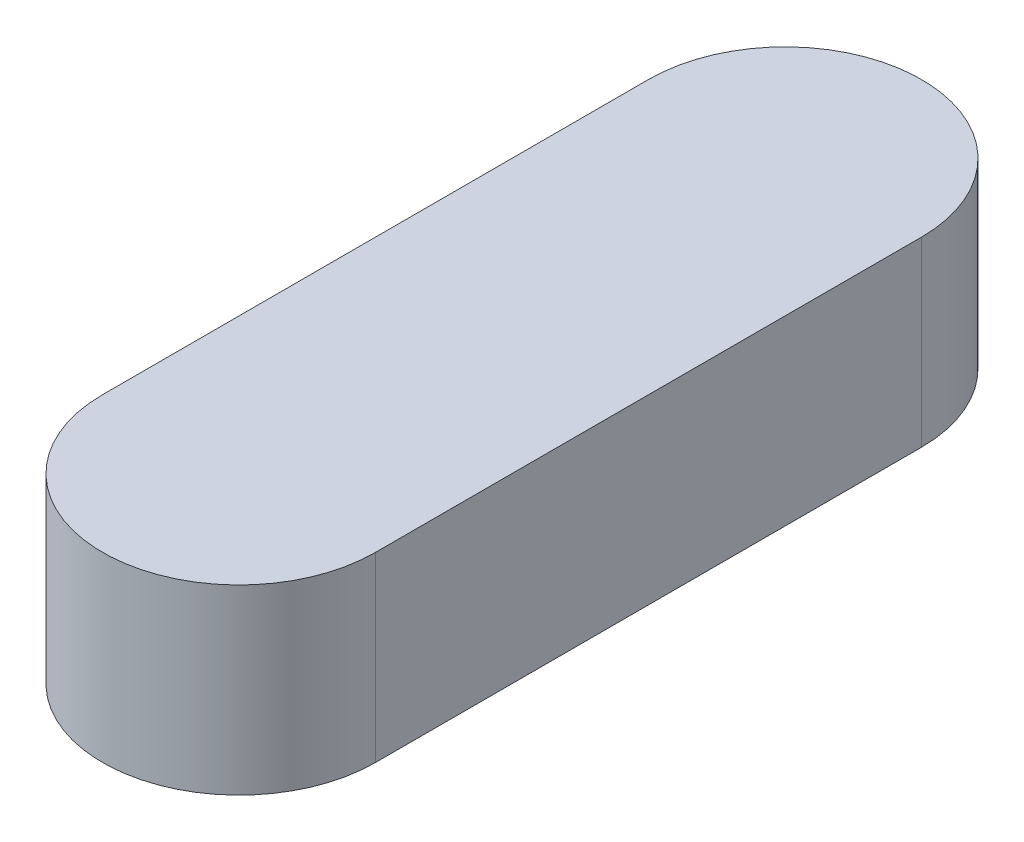
ISO-10303-21;
HEADER;
FILE_DESCRIPTION(('STEP AP214'),'2;1');
FILE_NAME('part.step','',(''),(''),'','','');
FILE_SCHEMA(('AUTOMOTIVE_DESIGN { 1 0 10303 214 1 1 1 1 }'));
ENDSEC;
DATA;
#1=APPLICATION_CONTEXT('core data for automotive mechanical design processes');
#2=APPLICATION_PROTOCOL_DEFINITION('international standard','automotive_design',2000,#1);
#3=PRODUCT_CONTEXT('',#1,'mechanical');
#4=PRODUCT('Part','Part','',(#3));
#5=PRODUCT_RELATED_PRODUCT_CATEGORY('part','',(#4));
#6=PRODUCT_DEFINITION_FORMATION('','',#4);
#7=PRODUCT_DEFINITION_CONTEXT('part definition',#1,'design');
#8=PRODUCT_DEFINITION('design','',#6,#7);
#9=PRODUCT_DEFINITION_SHAPE('','',#8);
#10=(LENGTH_UNIT() NAMED_UNIT(*) SI_UNIT(.MILLI.,.METRE.));
#11=(NAMED_UNIT(*) PLANE_ANGLE_UNIT() SI_UNIT($,.RADIAN.));
#12=(NAMED_UNIT(*) SI_UNIT($,.STERADIAN.) SOLID_ANGLE_UNIT());
#13=UNCERTAINTY_MEASURE_WITH_UNIT(LENGTH_MEASURE(1.E-05),#10,'distance_accuracy_value','');
#14=(GEOMETRIC_REPRESENTATION_CONTEXT(3) GLOBAL_UNCERTAINTY_ASSIGNED_CONTEXT((#13)) GLOBAL_UNIT_ASSIGNED_CONTEXT((#10,
#11,#12)) REPRESENTATION_CONTEXT('',''));
#15=CARTESIAN_POINT('',(0.,0.,0.));
#16=DIRECTION('',(0.,0.,1.));
#17=DIRECTION('',(1.,0.,0.));
#18=AXIS2_PLACEMENT_3D('',#15,#16,#17);
#19=CARTESIAN_POINT('',(0.,4.,-12.));
#20=DIRECTION('',(0.,-1.,0.));
#21=DIRECTION('',(0.,0.,-1.));
#22=AXIS2_PLACEMENT_3D('',#19,#20,#21);
#23=CYLINDRICAL_SURFACE('',#22,6.);
#24=CARTESIAN_POINT('',(0.,-4.,-12.));
#25=DIRECTION('',(0.,1.,0.));
#26=DIRECTION('',(0.,0.,1.));
#27=AXIS2_PLACEMENT_3D('',#24,#25,#26);
#28=CIRCLE('',#27,6.);
#29=CARTESIAN_POINT('',(6.,-4.,-12.));
#30=VERTEX_POINT('',#29);
#31=CARTESIAN_POINT('',(-6.,-4.,-12.));
#32=VERTEX_POINT('',#31);
#33=EDGE_CURVE('E100',#30,#32,#28,.T.);
#34=ORIENTED_EDGE('',*,*,#33,.T.);
#35=DIRECTION('',(0.,-1.,0.));
#36=VECTOR('',#35,1.);
#37=CARTESIAN_POINT('',(-6.,4.,-12.));
#38=LINE('',#37,#36);
#39=CARTESIAN_POINT('',(-6.,4.,-12.));
#40=VERTEX_POINT('',#39);
#41=EDGE_CURVE('E11',#40,#32,#38,.T.);
#42=ORIENTED_EDGE('',*,*,#41,.F.);
#43=CARTESIAN_POINT('',(0.,4.,-12.));
#44=DIRECTION('',(0.,1.,0.));
#45=DIRECTION('',(0.,0.,1.));
#46=AXIS2_PLACEMENT_3D('',#43,#44,#45);
#47=CIRCLE('',#46,6.);
#48=CARTESIAN_POINT('',(6.,4.,-12.));
#49=VERTEX_POINT('',#48);
#50=EDGE_CURVE('E88',#49,#40,#47,.T.);
#51=ORIENTED_EDGE('',*,*,#50,.F.);
#52=DIRECTION('',(0.,-1.,0.));
#53=VECTOR('',#52,1.);
#54=CARTESIAN_POINT('',(6.,4.,-12.));
#55=LINE('',#54,#53);
#56=EDGE_CURVE('E96',#49,#30,#55,.T.);
#57=ORIENTED_EDGE('',*,*,#56,.T.);
#58=EDGE_LOOP('',(#34,#42,#51,#57));
#59=FACE_BOUND('',#58,.T.);
#60=ADVANCED_FACE('F37',(#59),#23,.T.);
#61=CARTESIAN_POINT('',(-6.,4.,-12.));
#62=DIRECTION('',(1.,0.,0.));
#63=DIRECTION('',(0.,0.,-1.));
#64=AXIS2_PLACEMENT_3D('',#61,#62,#63);
#65=PLANE('',#64);
#66=DIRECTION('',(0.,0.,1.));
#67=VECTOR('',#66,1.);
#68=CARTESIAN_POINT('',(-6.,-4.,-12.));
#69=LINE('',#68,#67);
#70=CARTESIAN_POINT('',(-6.,-4.,12.));
#71=VERTEX_POINT('',#70);
#72=EDGE_CURVE('E92',#32,#71,#69,.T.);
#73=ORIENTED_EDGE('',*,*,#72,.T.);
#74=DIRECTION('',(0.,-1.,0.));
#75=VECTOR('',#74,1.);
#76=CARTESIAN_POINT('',(-6.,4.,12.));
#77=LINE('',#76,#75);
#78=CARTESIAN_POINT('',(-6.,4.,12.));
#79=VERTEX_POINT('',#78);
#80=EDGE_CURVE('E45',#79,#71,#77,.T.);
#81=ORIENTED_EDGE('',*,*,#80,.F.);
#82=DIRECTION('',(0.,0.,1.));
#83=VECTOR('',#82,1.);
#84=CARTESIAN_POINT('',(-6.,4.,-12.));
#85=LINE('',#84,#83);
#86=EDGE_CURVE('E83',#40,#79,#85,.T.);
#87=ORIENTED_EDGE('',*,*,#86,.F.);
#88=ORIENTED_EDGE('',*,*,#41,.T.);
#89=EDGE_LOOP('',(#73,#81,#87,#88));
#90=FACE_BOUND('',#89,.T.);
#91=ADVANCED_FACE('F91',(#90),#65,.F.);
#92=CARTESIAN_POINT('',(0.,4.,12.));
#93=DIRECTION('',(0.,-1.,0.));
#94=DIRECTION('',(0.,0.,-1.));
#95=AXIS2_PLACEMENT_3D('',#92,#93,#94);
#96=CYLINDRICAL_SURFACE('',#95,6.);
#97=CARTESIAN_POINT('',(0.,-4.,12.));
#98=DIRECTION('',(0.,1.,0.));
#99=DIRECTION('',(0.,0.,1.));
#100=AXIS2_PLACEMENT_3D('',#97,#98,#99);
#101=CIRCLE('',#100,6.);
#102=CARTESIAN_POINT('',(6.,-4.,12.));
#103=VERTEX_POINT('',#102);
#104=EDGE_CURVE('E70',#71,#103,#101,.T.);
#105=ORIENTED_EDGE('',*,*,#104,.T.);
#106=DIRECTION('',(0.,-1.,0.));
#107=VECTOR('',#106,1.);
#108=CARTESIAN_POINT('',(6.,4.,12.));
#109=LINE('',#108,#107);
#110=CARTESIAN_POINT('',(6.,4.,12.));
#111=VERTEX_POINT('',#110);
#112=EDGE_CURVE('E93',#111,#103,#109,.T.);
#113=ORIENTED_EDGE('',*,*,#112,.F.);
#114=CARTESIAN_POINT('',(0.,4.,12.));
#115=DIRECTION('',(0.,1.,0.));
#116=DIRECTION('',(0.,0.,1.));
#117=AXIS2_PLACEMENT_3D('',#114,#115,#116);
#118=CIRCLE('',#117,6.);
#119=EDGE_CURVE('E86',#79,#111,#118,.T.);
#120=ORIENTED_EDGE('',*,*,#119,.F.);
#121=ORIENTED_EDGE('',*,*,#80,.T.);
#122=EDGE_LOOP('',(#105,#113,#120,#121));
#123=FACE_BOUND('',#122,.T.);
#124=ADVANCED_FACE('F94',(#123),#96,.T.);
#125=CARTESIAN_POINT('',(6.,4.,12.));
#126=DIRECTION('',(-1.,0.,0.));
#127=DIRECTION('',(0.,0.,1.));
#128=AXIS2_PLACEMENT_3D('',#125,#126,#127);
#129=PLANE('',#128);
#130=DIRECTION('',(0.,0.,-1.));
#131=VECTOR('',#130,1.);
#132=CARTESIAN_POINT('',(6.,-4.,12.));
#133=LINE('',#132,#131);
#134=EDGE_CURVE('E76',#103,#30,#133,.T.);
#135=ORIENTED_EDGE('',*,*,#134,.T.);
#136=ORIENTED_EDGE('',*,*,#56,.F.);
#137=DIRECTION('',(0.,0.,-1.));
#138=VECTOR('',#137,1.);
#139=CARTESIAN_POINT('',(6.,4.,12.));
#140=LINE('',#139,#138);
#141=EDGE_CURVE('E53',#111,#49,#140,.T.);
#142=ORIENTED_EDGE('',*,*,#141,.F.);
#143=ORIENTED_EDGE('',*,*,#112,.T.);
#144=EDGE_LOOP('',(#135,#136,#142,#143));
#145=FACE_BOUND('',#144,.T.);
#146=ADVANCED_FACE('F107',(#145),#129,.F.);
#147=CARTESIAN_POINT('',(0.,4.,-12.));
#148=DIRECTION('',(0.,1.,0.));
#149=DIRECTION('',(0.,0.,1.));
#150=AXIS2_PLACEMENT_3D('',#147,#148,#149);
#151=PLANE('',#150);
#152=ORIENTED_EDGE('',*,*,#50,.T.);
#153=ORIENTED_EDGE('',*,*,#86,.T.);
#154=ORIENTED_EDGE('',*,*,#119,.T.);
#155=ORIENTED_EDGE('',*,*,#141,.T.);
#156=EDGE_LOOP('',(#152,#153,#154,#155));
#157=FACE_BOUND('',#156,.T.);
#158=ADVANCED_FACE('F84',(#157),#151,.T.);
#159=CARTESIAN_POINT('',(0.,-4.,-12.));
#160=DIRECTION('',(0.,1.,0.));
#161=DIRECTION('',(0.,0.,1.));
#162=AXIS2_PLACEMENT_3D('',#159,#160,#161);
#163=PLANE('',#162);
#164=ORIENTED_EDGE('',*,*,#33,.F.);
#165=ORIENTED_EDGE('',*,*,#134,.F.);
#166=ORIENTED_EDGE('',*,*,#104,.F.);
#167=ORIENTED_EDGE('',*,*,#72,.F.);
#168=EDGE_LOOP('',(#164,#165,#166,#167));
#169=FACE_BOUND('',#168,.T.);
#170=ADVANCED_FACE('F110',(#169),#163,.F.);
#171=CLOSED_SHELL('',(#60,#91,#124,#146,#158,#170));
#172=MANIFOLD_SOLID_BREP('B2',#171);
#173=ADVANCED_BREP_SHAPE_REPRESENTATION('',(#18,#172),#14);
#174=SHAPE_DEFINITION_REPRESENTATION(#9,#173);
ENDSEC;
END-ISO-10303-21;
